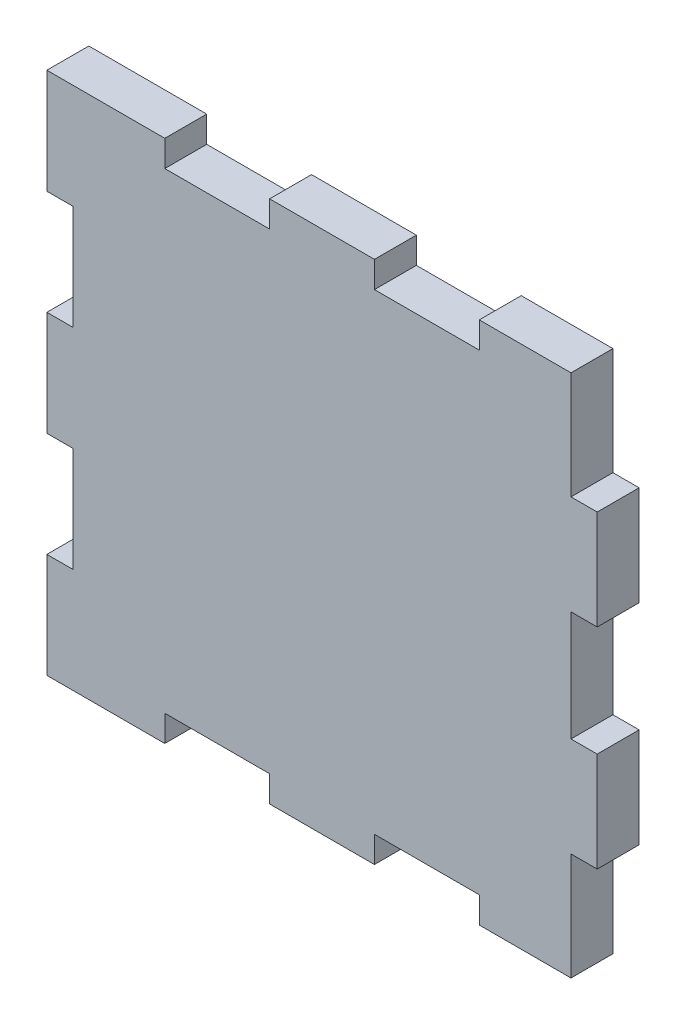
ISO-10303-21;
HEADER;
FILE_DESCRIPTION(('STEP AP214'),'2;1');
FILE_NAME('part.step','',(''),(''),'','','');
FILE_SCHEMA(('AUTOMOTIVE_DESIGN { 1 0 10303 214 1 1 1 1 }'));
ENDSEC;
DATA;
#1=APPLICATION_CONTEXT('core data for automotive mechanical design processes');
#2=APPLICATION_PROTOCOL_DEFINITION('international standard','automotive_design',2000,#1);
#3=PRODUCT_CONTEXT('',#1,'mechanical');
#4=PRODUCT('Part','Part','',(#3));
#5=PRODUCT_RELATED_PRODUCT_CATEGORY('part','',(#4));
#6=PRODUCT_DEFINITION_FORMATION('','',#4);
#7=PRODUCT_DEFINITION_CONTEXT('part definition',#1,'design');
#8=PRODUCT_DEFINITION('design','',#6,#7);
#9=PRODUCT_DEFINITION_SHAPE('','',#8);
#10=(LENGTH_UNIT() NAMED_UNIT(*) SI_UNIT(.MILLI.,.METRE.));
#11=(NAMED_UNIT(*) PLANE_ANGLE_UNIT() SI_UNIT($,.RADIAN.));
#12=(NAMED_UNIT(*) SI_UNIT($,.STERADIAN.) SOLID_ANGLE_UNIT());
#13=UNCERTAINTY_MEASURE_WITH_UNIT(LENGTH_MEASURE(1.E-05),#10,'distance_accuracy_value','');
#14=(GEOMETRIC_REPRESENTATION_CONTEXT(3) GLOBAL_UNCERTAINTY_ASSIGNED_CONTEXT((#13)) GLOBAL_UNIT_ASSIGNED_CONTEXT((#10,
#11,#12)) REPRESENTATION_CONTEXT('',''));
#15=CARTESIAN_POINT('',(0.,0.,0.));
#16=DIRECTION('',(0.,0.,1.));
#17=DIRECTION('',(1.,0.,0.));
#18=AXIS2_PLACEMENT_3D('',#15,#16,#17);
#19=CARTESIAN_POINT('',(66.145833333333,-85.5,0.));
#20=DIRECTION('',(0.,0.,1.));
#21=DIRECTION('',(1.,0.,0.));
#22=AXIS2_PLACEMENT_3D('',#19,#20,#21);
#23=PLANE('',#22);
#24=DIRECTION('',(1.,0.,0.));
#25=VECTOR('',#24,1.);
#26=CARTESIAN_POINT('',(60.4,-75.5,0.));
#27=LINE('',#26,#25);
#28=CARTESIAN_POINT('',(55.9,-75.5,0.));
#29=VERTEX_POINT('',#28);
#30=CARTESIAN_POINT('',(60.4,-75.5,0.));
#31=VERTEX_POINT('',#30);
#32=EDGE_CURVE('E428',#29,#31,#27,.T.);
#33=ORIENTED_EDGE('',*,*,#32,.T.);
#34=DIRECTION('',(0.,1.,0.));
#35=VECTOR('',#34,1.);
#36=CARTESIAN_POINT('',(60.4,-76.5,0.));
#37=LINE('',#36,#35);
#38=CARTESIAN_POINT('',(60.4,-76.5,0.));
#39=VERTEX_POINT('',#38);
#40=EDGE_CURVE('E423',#31,#39,#37,.F.);
#41=ORIENTED_EDGE('',*,*,#40,.T.);
#42=DIRECTION('',(1.,0.,0.));
#43=VECTOR('',#42,1.);
#44=CARTESIAN_POINT('',(64.4,-76.5,0.));
#45=LINE('',#44,#43);
#46=CARTESIAN_POINT('',(64.4,-76.5,0.));
#47=VERTEX_POINT('',#46);
#48=EDGE_CURVE('E418',#39,#47,#45,.T.);
#49=ORIENTED_EDGE('',*,*,#48,.T.);
#50=DIRECTION('',(0.,1.,0.));
#51=VECTOR('',#50,1.);
#52=CARTESIAN_POINT('',(64.4,-75.5,0.));
#53=LINE('',#52,#51);
#54=CARTESIAN_POINT('',(64.4,-75.5,0.));
#55=VERTEX_POINT('',#54);
#56=EDGE_CURVE('E413',#47,#55,#53,.T.);
#57=ORIENTED_EDGE('',*,*,#56,.T.);
#58=DIRECTION('',(1.,0.,0.));
#59=VECTOR('',#58,1.);
#60=CARTESIAN_POINT('',(68.4,-75.5,0.));
#61=LINE('',#60,#59);
#62=CARTESIAN_POINT('',(68.4,-75.5,0.));
#63=VERTEX_POINT('',#62);
#64=EDGE_CURVE('E408',#55,#63,#61,.T.);
#65=ORIENTED_EDGE('',*,*,#64,.T.);
#66=DIRECTION('',(0.,1.,0.));
#67=VECTOR('',#66,1.);
#68=CARTESIAN_POINT('',(68.4,-76.5,0.));
#69=LINE('',#68,#67);
#70=CARTESIAN_POINT('',(68.4,-76.5,0.));
#71=VERTEX_POINT('',#70);
#72=EDGE_CURVE('E403',#63,#71,#69,.F.);
#73=ORIENTED_EDGE('',*,*,#72,.T.);
#74=DIRECTION('',(1.,0.,0.));
#75=VECTOR('',#74,1.);
#76=CARTESIAN_POINT('',(72.4,-76.5,0.));
#77=LINE('',#76,#75);
#78=CARTESIAN_POINT('',(72.4,-76.5,0.));
#79=VERTEX_POINT('',#78);
#80=EDGE_CURVE('E398',#71,#79,#77,.T.);
#81=ORIENTED_EDGE('',*,*,#80,.T.);
#82=DIRECTION('',(0.,1.,0.));
#83=VECTOR('',#82,1.);
#84=CARTESIAN_POINT('',(72.4,-75.5,0.));
#85=LINE('',#84,#83);
#86=CARTESIAN_POINT('',(72.4,-75.5,0.));
#87=VERTEX_POINT('',#86);
#88=EDGE_CURVE('E393',#79,#87,#85,.T.);
#89=ORIENTED_EDGE('',*,*,#88,.T.);
#90=DIRECTION('',(1.,0.,0.));
#91=VECTOR('',#90,1.);
#92=CARTESIAN_POINT('',(75.9,-75.5,0.));
#93=LINE('',#92,#91);
#94=CARTESIAN_POINT('',(75.9,-75.5,0.));
#95=VERTEX_POINT('',#94);
#96=EDGE_CURVE('E388',#87,#95,#93,.T.);
#97=ORIENTED_EDGE('',*,*,#96,.T.);
#98=DIRECTION('',(0.,1.,0.));
#99=VECTOR('',#98,1.);
#100=CARTESIAN_POINT('',(75.9,-79.6,0.));
#101=LINE('',#100,#99);
#102=CARTESIAN_POINT('',(75.9,-79.6,0.));
#103=VERTEX_POINT('',#102);
#104=EDGE_CURVE('E383',#95,#103,#101,.F.);
#105=ORIENTED_EDGE('',*,*,#104,.T.);
#106=DIRECTION('',(1.,0.,0.));
#107=VECTOR('',#106,1.);
#108=CARTESIAN_POINT('',(76.9,-79.6,0.));
#109=LINE('',#108,#107);
#110=CARTESIAN_POINT('',(76.9,-79.6,0.));
#111=VERTEX_POINT('',#110);
#112=EDGE_CURVE('E378',#103,#111,#109,.T.);
#113=ORIENTED_EDGE('',*,*,#112,.T.);
#114=DIRECTION('',(0.,1.,0.));
#115=VECTOR('',#114,1.);
#116=CARTESIAN_POINT('',(76.9,-83.4,0.));
#117=LINE('',#116,#115);
#118=CARTESIAN_POINT('',(76.9,-83.4,0.));
#119=VERTEX_POINT('',#118);
#120=EDGE_CURVE('E373',#111,#119,#117,.F.);
#121=ORIENTED_EDGE('',*,*,#120,.T.);
#122=DIRECTION('',(1.,0.,0.));
#123=VECTOR('',#122,1.);
#124=CARTESIAN_POINT('',(75.9,-83.4,0.));
#125=LINE('',#124,#123);
#126=CARTESIAN_POINT('',(75.9,-83.4,0.));
#127=VERTEX_POINT('',#126);
#128=EDGE_CURVE('E368',#119,#127,#125,.F.);
#129=ORIENTED_EDGE('',*,*,#128,.T.);
#130=DIRECTION('',(0.,1.,0.));
#131=VECTOR('',#130,1.);
#132=CARTESIAN_POINT('',(75.9,-87.6,0.));
#133=LINE('',#132,#131);
#134=CARTESIAN_POINT('',(75.9,-87.6,0.));
#135=VERTEX_POINT('',#134);
#136=EDGE_CURVE('E363',#127,#135,#133,.F.);
#137=ORIENTED_EDGE('',*,*,#136,.T.);
#138=DIRECTION('',(1.,0.,0.));
#139=VECTOR('',#138,1.);
#140=CARTESIAN_POINT('',(76.9,-87.6,0.));
#141=LINE('',#140,#139);
#142=CARTESIAN_POINT('',(76.9,-87.6,0.));
#143=VERTEX_POINT('',#142);
#144=EDGE_CURVE('E358',#135,#143,#141,.T.);
#145=ORIENTED_EDGE('',*,*,#144,.T.);
#146=DIRECTION('',(0.,1.,0.));
#147=VECTOR('',#146,1.);
#148=CARTESIAN_POINT('',(76.9,-91.4,0.));
#149=LINE('',#148,#147);
#150=CARTESIAN_POINT('',(76.9,-91.4,0.));
#151=VERTEX_POINT('',#150);
#152=EDGE_CURVE('E353',#143,#151,#149,.F.);
#153=ORIENTED_EDGE('',*,*,#152,.T.);
#154=DIRECTION('',(1.,0.,0.));
#155=VECTOR('',#154,1.);
#156=CARTESIAN_POINT('',(75.9,-91.4,0.));
#157=LINE('',#156,#155);
#158=CARTESIAN_POINT('',(75.9,-91.4,0.));
#159=VERTEX_POINT('',#158);
#160=EDGE_CURVE('E348',#151,#159,#157,.F.);
#161=ORIENTED_EDGE('',*,*,#160,.T.);
#162=DIRECTION('',(0.,1.,0.));
#163=VECTOR('',#162,1.);
#164=CARTESIAN_POINT('',(75.9,-95.5,0.));
#165=LINE('',#164,#163);
#166=CARTESIAN_POINT('',(75.9,-95.5,0.));
#167=VERTEX_POINT('',#166);
#168=EDGE_CURVE('E343',#159,#167,#165,.F.);
#169=ORIENTED_EDGE('',*,*,#168,.T.);
#170=DIRECTION('',(1.,0.,0.));
#171=VECTOR('',#170,1.);
#172=CARTESIAN_POINT('',(72.4,-95.5,0.));
#173=LINE('',#172,#171);
#174=CARTESIAN_POINT('',(72.4,-95.5,0.));
#175=VERTEX_POINT('',#174);
#176=EDGE_CURVE('E338',#167,#175,#173,.F.);
#177=ORIENTED_EDGE('',*,*,#176,.T.);
#178=DIRECTION('',(0.,1.,0.));
#179=VECTOR('',#178,1.);
#180=CARTESIAN_POINT('',(72.4,-94.5,0.));
#181=LINE('',#180,#179);
#182=CARTESIAN_POINT('',(72.4,-94.5,0.));
#183=VERTEX_POINT('',#182);
#184=EDGE_CURVE('E333',#175,#183,#181,.T.);
#185=ORIENTED_EDGE('',*,*,#184,.T.);
#186=DIRECTION('',(1.,0.,0.));
#187=VECTOR('',#186,1.);
#188=CARTESIAN_POINT('',(68.4,-94.5,0.));
#189=LINE('',#188,#187);
#190=CARTESIAN_POINT('',(68.4,-94.5,0.));
#191=VERTEX_POINT('',#190);
#192=EDGE_CURVE('E328',#183,#191,#189,.F.);
#193=ORIENTED_EDGE('',*,*,#192,.T.);
#194=DIRECTION('',(0.,1.,0.));
#195=VECTOR('',#194,1.);
#196=CARTESIAN_POINT('',(68.4,-95.5,0.));
#197=LINE('',#196,#195);
#198=CARTESIAN_POINT('',(68.4,-95.5,0.));
#199=VERTEX_POINT('',#198);
#200=EDGE_CURVE('E323',#191,#199,#197,.F.);
#201=ORIENTED_EDGE('',*,*,#200,.T.);
#202=DIRECTION('',(1.,0.,0.));
#203=VECTOR('',#202,1.);
#204=CARTESIAN_POINT('',(64.4,-95.5,0.));
#205=LINE('',#204,#203);
#206=CARTESIAN_POINT('',(64.4,-95.5,0.));
#207=VERTEX_POINT('',#206);
#208=EDGE_CURVE('E318',#199,#207,#205,.F.);
#209=ORIENTED_EDGE('',*,*,#208,.T.);
#210=DIRECTION('',(0.,1.,0.));
#211=VECTOR('',#210,1.);
#212=CARTESIAN_POINT('',(64.4,-94.5,0.));
#213=LINE('',#212,#211);
#214=CARTESIAN_POINT('',(64.4,-94.5,0.));
#215=VERTEX_POINT('',#214);
#216=EDGE_CURVE('E313',#207,#215,#213,.T.);
#217=ORIENTED_EDGE('',*,*,#216,.T.);
#218=DIRECTION('',(1.,0.,0.));
#219=VECTOR('',#218,1.);
#220=CARTESIAN_POINT('',(60.4,-94.5,0.));
#221=LINE('',#220,#219);
#222=CARTESIAN_POINT('',(60.4,-94.5,0.));
#223=VERTEX_POINT('',#222);
#224=EDGE_CURVE('E308',#215,#223,#221,.F.);
#225=ORIENTED_EDGE('',*,*,#224,.T.);
#226=DIRECTION('',(0.,1.,0.));
#227=VECTOR('',#226,1.);
#228=CARTESIAN_POINT('',(60.4,-95.5,0.));
#229=LINE('',#228,#227);
#230=CARTESIAN_POINT('',(60.4,-95.5,0.));
#231=VERTEX_POINT('',#230);
#232=EDGE_CURVE('E303',#223,#231,#229,.F.);
#233=ORIENTED_EDGE('',*,*,#232,.T.);
#234=DIRECTION('',(1.,0.,0.));
#235=VECTOR('',#234,1.);
#236=CARTESIAN_POINT('',(55.9,-95.5,0.));
#237=LINE('',#236,#235);
#238=CARTESIAN_POINT('',(55.9,-95.5,0.));
#239=VERTEX_POINT('',#238);
#240=EDGE_CURVE('E298',#231,#239,#237,.F.);
#241=ORIENTED_EDGE('',*,*,#240,.T.);
#242=DIRECTION('',(0.,1.,0.));
#243=VECTOR('',#242,1.);
#244=CARTESIAN_POINT('',(55.9,-91.5,0.));
#245=LINE('',#244,#243);
#246=CARTESIAN_POINT('',(55.9,-91.5,0.));
#247=VERTEX_POINT('',#246);
#248=EDGE_CURVE('E293',#239,#247,#245,.T.);
#249=ORIENTED_EDGE('',*,*,#248,.T.);
#250=DIRECTION('',(1.,0.,0.));
#251=VECTOR('',#250,1.);
#252=CARTESIAN_POINT('',(56.9,-91.5,0.));
#253=LINE('',#252,#251);
#254=CARTESIAN_POINT('',(56.9,-91.5,0.));
#255=VERTEX_POINT('',#254);
#256=EDGE_CURVE('E288',#247,#255,#253,.T.);
#257=ORIENTED_EDGE('',*,*,#256,.T.);
#258=DIRECTION('',(0.,1.,0.));
#259=VECTOR('',#258,1.);
#260=CARTESIAN_POINT('',(56.9,-87.5,0.));
#261=LINE('',#260,#259);
#262=CARTESIAN_POINT('',(56.9,-87.5,0.));
#263=VERTEX_POINT('',#262);
#264=EDGE_CURVE('E283',#255,#263,#261,.T.);
#265=ORIENTED_EDGE('',*,*,#264,.T.);
#266=DIRECTION('',(1.,0.,0.));
#267=VECTOR('',#266,1.);
#268=CARTESIAN_POINT('',(55.9,-87.5,0.));
#269=LINE('',#268,#267);
#270=CARTESIAN_POINT('',(55.9,-87.5,0.));
#271=VERTEX_POINT('',#270);
#272=EDGE_CURVE('E278',#263,#271,#269,.F.);
#273=ORIENTED_EDGE('',*,*,#272,.T.);
#274=DIRECTION('',(0.,1.,0.));
#275=VECTOR('',#274,1.);
#276=CARTESIAN_POINT('',(55.9,-83.5,0.));
#277=LINE('',#276,#275);
#278=CARTESIAN_POINT('',(55.9,-83.5,0.));
#279=VERTEX_POINT('',#278);
#280=EDGE_CURVE('E274',#271,#279,#277,.T.);
#281=ORIENTED_EDGE('',*,*,#280,.T.);
#282=DIRECTION('',(1.,0.,0.));
#283=VECTOR('',#282,1.);
#284=CARTESIAN_POINT('',(56.9,-83.5,0.));
#285=LINE('',#284,#283);
#286=CARTESIAN_POINT('',(56.9,-83.5,0.));
#287=VERTEX_POINT('',#286);
#288=EDGE_CURVE('E261',#279,#287,#285,.T.);
#289=ORIENTED_EDGE('',*,*,#288,.T.);
#290=DIRECTION('',(0.,1.,0.));
#291=VECTOR('',#290,1.);
#292=CARTESIAN_POINT('',(56.9,-79.5,0.));
#293=LINE('',#292,#291);
#294=CARTESIAN_POINT('',(56.9,-79.5,0.));
#295=VERTEX_POINT('',#294);
#296=EDGE_CURVE('E246',#287,#295,#293,.T.);
#297=ORIENTED_EDGE('',*,*,#296,.T.);
#298=DIRECTION('',(1.,0.,0.));
#299=VECTOR('',#298,1.);
#300=CARTESIAN_POINT('',(55.9,-79.5,0.));
#301=LINE('',#300,#299);
#302=CARTESIAN_POINT('',(55.9,-79.5,0.));
#303=VERTEX_POINT('',#302);
#304=EDGE_CURVE('E19',#295,#303,#301,.F.);
#305=ORIENTED_EDGE('',*,*,#304,.T.);
#306=DIRECTION('',(0.,1.,0.));
#307=VECTOR('',#306,1.);
#308=CARTESIAN_POINT('',(55.9,-75.5,0.));
#309=LINE('',#308,#307);
#310=EDGE_CURVE('E432',#303,#29,#309,.T.);
#311=ORIENTED_EDGE('',*,*,#310,.T.);
#312=EDGE_LOOP('',(#33,#41,#49,#57,#65,#73,#81,#89,#97,#105,#113,#121,#129,#137,#145,#153,#161,
#169,#177,#185,#193,#201,#209,#217,#225,#233,#241,#249,#257,#265,#273,#281,#289,#297,#305,#311));
#313=FACE_BOUND('',#312,.T.);
#314=ADVANCED_FACE('F16',(#313),#23,.F.);
#315=CARTESIAN_POINT('',(55.9,-79.5,0.));
#316=DIRECTION('',(0.,1.,0.));
#317=DIRECTION('',(0.,0.,1.));
#318=AXIS2_PLACEMENT_3D('',#315,#316,#317);
#319=PLANE('',#318);
#320=DIRECTION('',(0.,0.,-1.));
#321=VECTOR('',#320,1.);
#322=CARTESIAN_POINT('',(56.9,-79.5,0.));
#323=LINE('',#322,#321);
#324=CARTESIAN_POINT('',(56.9,-79.5,1.6));
#325=VERTEX_POINT('',#324);
#326=EDGE_CURVE('E252',#295,#325,#323,.F.);
#327=ORIENTED_EDGE('',*,*,#326,.T.);
#328=DIRECTION('',(1.,0.,0.));
#329=VECTOR('',#328,1.);
#330=CARTESIAN_POINT('',(66.145833333333,-79.5,1.6));
#331=LINE('',#330,#329);
#332=CARTESIAN_POINT('',(55.9,-79.5,1.6));
#333=VERTEX_POINT('',#332);
#334=EDGE_CURVE('E434',#333,#325,#331,.T.);
#335=ORIENTED_EDGE('',*,*,#334,.F.);
#336=DIRECTION('',(0.,0.,-1.));
#337=VECTOR('',#336,1.);
#338=CARTESIAN_POINT('',(55.9,-79.5,0.));
#339=LINE('',#338,#337);
#340=EDGE_CURVE('E255',#333,#303,#339,.T.);
#341=ORIENTED_EDGE('',*,*,#340,.T.);
#342=ORIENTED_EDGE('',*,*,#304,.F.);
#343=EDGE_LOOP('',(#327,#335,#341,#342));
#344=FACE_BOUND('',#343,.T.);
#345=ADVANCED_FACE('F251',(#344),#319,.F.);
#346=CARTESIAN_POINT('',(56.9,-79.5,0.));
#347=DIRECTION('',(1.,0.,0.));
#348=DIRECTION('',(0.,0.,-1.));
#349=AXIS2_PLACEMENT_3D('',#346,#347,#348);
#350=PLANE('',#349);
#351=DIRECTION('',(0.,0.,-1.));
#352=VECTOR('',#351,1.);
#353=CARTESIAN_POINT('',(56.9,-83.5,0.));
#354=LINE('',#353,#352);
#355=CARTESIAN_POINT('',(56.9,-83.5,1.6));
#356=VERTEX_POINT('',#355);
#357=EDGE_CURVE('E263',#287,#356,#354,.F.);
#358=ORIENTED_EDGE('',*,*,#357,.T.);
#359=DIRECTION('',(0.,1.,0.));
#360=VECTOR('',#359,1.);
#361=CARTESIAN_POINT('',(56.9,-85.5,1.6));
#362=LINE('',#361,#360);
#363=EDGE_CURVE('E267',#325,#356,#362,.F.);
#364=ORIENTED_EDGE('',*,*,#363,.F.);
#365=ORIENTED_EDGE('',*,*,#326,.F.);
#366=ORIENTED_EDGE('',*,*,#296,.F.);
#367=EDGE_LOOP('',(#358,#364,#365,#366));
#368=FACE_BOUND('',#367,.T.);
#369=ADVANCED_FACE('F265',(#368),#350,.F.);
#370=CARTESIAN_POINT('',(56.9,-83.5,0.));
#371=DIRECTION('',(0.,-1.,0.));
#372=DIRECTION('',(0.,0.,-1.));
#373=AXIS2_PLACEMENT_3D('',#370,#371,#372);
#374=PLANE('',#373);
#375=DIRECTION('',(0.,0.,-1.));
#376=VECTOR('',#375,1.);
#377=CARTESIAN_POINT('',(55.9,-83.5,0.));
#378=LINE('',#377,#376);
#379=CARTESIAN_POINT('',(55.9,-83.5,1.6));
#380=VERTEX_POINT('',#379);
#381=EDGE_CURVE('E272',#279,#380,#378,.F.);
#382=ORIENTED_EDGE('',*,*,#381,.T.);
#383=DIRECTION('',(1.,0.,0.));
#384=VECTOR('',#383,1.);
#385=CARTESIAN_POINT('',(66.145833333333,-83.5,1.6));
#386=LINE('',#385,#384);
#387=EDGE_CURVE('E437',#356,#380,#386,.F.);
#388=ORIENTED_EDGE('',*,*,#387,.F.);
#389=ORIENTED_EDGE('',*,*,#357,.F.);
#390=ORIENTED_EDGE('',*,*,#288,.F.);
#391=EDGE_LOOP('',(#382,#388,#389,#390));
#392=FACE_BOUND('',#391,.T.);
#393=ADVANCED_FACE('F675',(#392),#374,.F.);
#394=CARTESIAN_POINT('',(55.9,-83.5,0.));
#395=DIRECTION('',(1.,0.,0.));
#396=DIRECTION('',(0.,0.,-1.));
#397=AXIS2_PLACEMENT_3D('',#394,#395,#396);
#398=PLANE('',#397);
#399=DIRECTION('',(0.,0.,1.));
#400=VECTOR('',#399,1.);
#401=CARTESIAN_POINT('',(55.9,-87.5,0.));
#402=LINE('',#401,#400);
#403=CARTESIAN_POINT('',(55.9,-87.5,1.6));
#404=VERTEX_POINT('',#403);
#405=EDGE_CURVE('E276',#271,#404,#402,.T.);
#406=ORIENTED_EDGE('',*,*,#405,.T.);
#407=DIRECTION('',(0.,1.,0.));
#408=VECTOR('',#407,1.);
#409=CARTESIAN_POINT('',(55.9,-85.5,1.6));
#410=LINE('',#409,#408);
#411=EDGE_CURVE('E440',#380,#404,#410,.F.);
#412=ORIENTED_EDGE('',*,*,#411,.F.);
#413=ORIENTED_EDGE('',*,*,#381,.F.);
#414=ORIENTED_EDGE('',*,*,#280,.F.);
#415=EDGE_LOOP('',(#406,#412,#413,#414));
#416=FACE_BOUND('',#415,.T.);
#417=ADVANCED_FACE('F671',(#416),#398,.F.);
#418=CARTESIAN_POINT('',(55.9,-87.5,0.));
#419=DIRECTION('',(0.,1.,0.));
#420=DIRECTION('',(0.,0.,1.));
#421=AXIS2_PLACEMENT_3D('',#418,#419,#420);
#422=PLANE('',#421);
#423=DIRECTION('',(0.,0.,-1.));
#424=VECTOR('',#423,1.);
#425=CARTESIAN_POINT('',(56.9,-87.5,0.));
#426=LINE('',#425,#424);
#427=CARTESIAN_POINT('',(56.9,-87.5,1.6));
#428=VERTEX_POINT('',#427);
#429=EDGE_CURVE('E281',#263,#428,#426,.F.);
#430=ORIENTED_EDGE('',*,*,#429,.T.);
#431=DIRECTION('',(1.,0.,0.));
#432=VECTOR('',#431,1.);
#433=CARTESIAN_POINT('',(66.145833333333,-87.5,1.6));
#434=LINE('',#433,#432);
#435=EDGE_CURVE('E443',#404,#428,#434,.T.);
#436=ORIENTED_EDGE('',*,*,#435,.F.);
#437=ORIENTED_EDGE('',*,*,#405,.F.);
#438=ORIENTED_EDGE('',*,*,#272,.F.);
#439=EDGE_LOOP('',(#430,#436,#437,#438));
#440=FACE_BOUND('',#439,.T.);
#441=ADVANCED_FACE('F667',(#440),#422,.F.);
#442=CARTESIAN_POINT('',(56.9,-87.5,0.));
#443=DIRECTION('',(1.,0.,0.));
#444=DIRECTION('',(0.,0.,-1.));
#445=AXIS2_PLACEMENT_3D('',#442,#443,#444);
#446=PLANE('',#445);
#447=DIRECTION('',(0.,0.,-1.));
#448=VECTOR('',#447,1.);
#449=CARTESIAN_POINT('',(56.9,-91.5,0.));
#450=LINE('',#449,#448);
#451=CARTESIAN_POINT('',(56.9,-91.5,1.6));
#452=VERTEX_POINT('',#451);
#453=EDGE_CURVE('E286',#255,#452,#450,.F.);
#454=ORIENTED_EDGE('',*,*,#453,.T.);
#455=DIRECTION('',(0.,1.,0.));
#456=VECTOR('',#455,1.);
#457=CARTESIAN_POINT('',(56.9,-85.5,1.6));
#458=LINE('',#457,#456);
#459=EDGE_CURVE('E446',#428,#452,#458,.F.);
#460=ORIENTED_EDGE('',*,*,#459,.F.);
#461=ORIENTED_EDGE('',*,*,#429,.F.);
#462=ORIENTED_EDGE('',*,*,#264,.F.);
#463=EDGE_LOOP('',(#454,#460,#461,#462));
#464=FACE_BOUND('',#463,.T.);
#465=ADVANCED_FACE('F663',(#464),#446,.F.);
#466=CARTESIAN_POINT('',(56.9,-91.5,0.));
#467=DIRECTION('',(0.,-1.,0.));
#468=DIRECTION('',(0.,0.,-1.));
#469=AXIS2_PLACEMENT_3D('',#466,#467,#468);
#470=PLANE('',#469);
#471=DIRECTION('',(0.,0.,-1.));
#472=VECTOR('',#471,1.);
#473=CARTESIAN_POINT('',(55.9,-91.5,0.));
#474=LINE('',#473,#472);
#475=CARTESIAN_POINT('',(55.9,-91.5,1.6));
#476=VERTEX_POINT('',#475);
#477=EDGE_CURVE('E291',#247,#476,#474,.F.);
#478=ORIENTED_EDGE('',*,*,#477,.T.);
#479=DIRECTION('',(1.,0.,0.));
#480=VECTOR('',#479,1.);
#481=CARTESIAN_POINT('',(66.145833333333,-91.5,1.6));
#482=LINE('',#481,#480);
#483=EDGE_CURVE('E449',#452,#476,#482,.F.);
#484=ORIENTED_EDGE('',*,*,#483,.F.);
#485=ORIENTED_EDGE('',*,*,#453,.F.);
#486=ORIENTED_EDGE('',*,*,#256,.F.);
#487=EDGE_LOOP('',(#478,#484,#485,#486));
#488=FACE_BOUND('',#487,.T.);
#489=ADVANCED_FACE('F659',(#488),#470,.F.);
#490=CARTESIAN_POINT('',(55.9,-91.5,0.));
#491=DIRECTION('',(1.,0.,0.));
#492=DIRECTION('',(0.,0.,-1.));
#493=AXIS2_PLACEMENT_3D('',#490,#491,#492);
#494=PLANE('',#493);
#495=DIRECTION('',(0.,0.,1.));
#496=VECTOR('',#495,1.);
#497=CARTESIAN_POINT('',(55.9,-95.5,0.));
#498=LINE('',#497,#496);
#499=CARTESIAN_POINT('',(55.9,-95.5,1.6));
#500=VERTEX_POINT('',#499);
#501=EDGE_CURVE('E296',#239,#500,#498,.T.);
#502=ORIENTED_EDGE('',*,*,#501,.T.);
#503=DIRECTION('',(0.,1.,0.));
#504=VECTOR('',#503,1.);
#505=CARTESIAN_POINT('',(55.9,-85.5,1.6));
#506=LINE('',#505,#504);
#507=EDGE_CURVE('E452',#476,#500,#506,.F.);
#508=ORIENTED_EDGE('',*,*,#507,.F.);
#509=ORIENTED_EDGE('',*,*,#477,.F.);
#510=ORIENTED_EDGE('',*,*,#248,.F.);
#511=EDGE_LOOP('',(#502,#508,#509,#510));
#512=FACE_BOUND('',#511,.T.);
#513=ADVANCED_FACE('F655',(#512),#494,.F.);
#514=CARTESIAN_POINT('',(55.9,-95.5,0.));
#515=DIRECTION('',(0.,1.,0.));
#516=DIRECTION('',(0.,0.,1.));
#517=AXIS2_PLACEMENT_3D('',#514,#515,#516);
#518=PLANE('',#517);
#519=DIRECTION('',(0.,0.,1.));
#520=VECTOR('',#519,1.);
#521=CARTESIAN_POINT('',(60.4,-95.5,0.));
#522=LINE('',#521,#520);
#523=CARTESIAN_POINT('',(60.4,-95.5,1.6));
#524=VERTEX_POINT('',#523);
#525=EDGE_CURVE('E301',#231,#524,#522,.T.);
#526=ORIENTED_EDGE('',*,*,#525,.T.);
#527=DIRECTION('',(1.,0.,0.));
#528=VECTOR('',#527,1.);
#529=CARTESIAN_POINT('',(66.145833333333,-95.5,1.6));
#530=LINE('',#529,#528);
#531=EDGE_CURVE('E455',#500,#524,#530,.T.);
#532=ORIENTED_EDGE('',*,*,#531,.F.);
#533=ORIENTED_EDGE('',*,*,#501,.F.);
#534=ORIENTED_EDGE('',*,*,#240,.F.);
#535=EDGE_LOOP('',(#526,#532,#533,#534));
#536=FACE_BOUND('',#535,.T.);
#537=ADVANCED_FACE('F651',(#536),#518,.F.);
#538=CARTESIAN_POINT('',(60.4,-95.5,0.));
#539=DIRECTION('',(-1.,0.,0.));
#540=DIRECTION('',(0.,0.,1.));
#541=AXIS2_PLACEMENT_3D('',#538,#539,#540);
#542=PLANE('',#541);
#543=DIRECTION('',(0.,0.,1.));
#544=VECTOR('',#543,1.);
#545=CARTESIAN_POINT('',(60.4,-94.5,0.));
#546=LINE('',#545,#544);
#547=CARTESIAN_POINT('',(60.4,-94.5,1.6));
#548=VERTEX_POINT('',#547);
#549=EDGE_CURVE('E306',#223,#548,#546,.T.);
#550=ORIENTED_EDGE('',*,*,#549,.T.);
#551=DIRECTION('',(0.,1.,0.));
#552=VECTOR('',#551,1.);
#553=CARTESIAN_POINT('',(60.4,-85.5,1.6));
#554=LINE('',#553,#552);
#555=EDGE_CURVE('E458',#524,#548,#554,.T.);
#556=ORIENTED_EDGE('',*,*,#555,.F.);
#557=ORIENTED_EDGE('',*,*,#525,.F.);
#558=ORIENTED_EDGE('',*,*,#232,.F.);
#559=EDGE_LOOP('',(#550,#556,#557,#558));
#560=FACE_BOUND('',#559,.T.);
#561=ADVANCED_FACE('F647',(#560),#542,.F.);
#562=CARTESIAN_POINT('',(60.4,-94.5,0.));
#563=DIRECTION('',(0.,1.,0.));
#564=DIRECTION('',(0.,0.,1.));
#565=AXIS2_PLACEMENT_3D('',#562,#563,#564);
#566=PLANE('',#565);
#567=DIRECTION('',(0.,0.,-1.));
#568=VECTOR('',#567,1.);
#569=CARTESIAN_POINT('',(64.4,-94.5,0.));
#570=LINE('',#569,#568);
#571=CARTESIAN_POINT('',(64.4,-94.5,1.6));
#572=VERTEX_POINT('',#571);
#573=EDGE_CURVE('E311',#215,#572,#570,.F.);
#574=ORIENTED_EDGE('',*,*,#573,.T.);
#575=DIRECTION('',(1.,0.,0.));
#576=VECTOR('',#575,1.);
#577=CARTESIAN_POINT('',(66.145833333333,-94.5,1.6));
#578=LINE('',#577,#576);
#579=EDGE_CURVE('E461',#548,#572,#578,.T.);
#580=ORIENTED_EDGE('',*,*,#579,.F.);
#581=ORIENTED_EDGE('',*,*,#549,.F.);
#582=ORIENTED_EDGE('',*,*,#224,.F.);
#583=EDGE_LOOP('',(#574,#580,#581,#582));
#584=FACE_BOUND('',#583,.T.);
#585=ADVANCED_FACE('F643',(#584),#566,.F.);
#586=CARTESIAN_POINT('',(64.4,-94.5,0.));
#587=DIRECTION('',(1.,0.,0.));
#588=DIRECTION('',(0.,0.,-1.));
#589=AXIS2_PLACEMENT_3D('',#586,#587,#588);
#590=PLANE('',#589);
#591=DIRECTION('',(0.,0.,1.));
#592=VECTOR('',#591,1.);
#593=CARTESIAN_POINT('',(64.4,-95.5,0.));
#594=LINE('',#593,#592);
#595=CARTESIAN_POINT('',(64.4,-95.5,1.6));
#596=VERTEX_POINT('',#595);
#597=EDGE_CURVE('E316',#207,#596,#594,.T.);
#598=ORIENTED_EDGE('',*,*,#597,.T.);
#599=DIRECTION('',(0.,1.,0.));
#600=VECTOR('',#599,1.);
#601=CARTESIAN_POINT('',(64.4,-85.5,1.6));
#602=LINE('',#601,#600);
#603=EDGE_CURVE('E464',#572,#596,#602,.F.);
#604=ORIENTED_EDGE('',*,*,#603,.F.);
#605=ORIENTED_EDGE('',*,*,#573,.F.);
#606=ORIENTED_EDGE('',*,*,#216,.F.);
#607=EDGE_LOOP('',(#598,#604,#605,#606));
#608=FACE_BOUND('',#607,.T.);
#609=ADVANCED_FACE('F639',(#608),#590,.F.);
#610=CARTESIAN_POINT('',(64.4,-95.5,0.));
#611=DIRECTION('',(0.,1.,0.));
#612=DIRECTION('',(0.,0.,1.));
#613=AXIS2_PLACEMENT_3D('',#610,#611,#612);
#614=PLANE('',#613);
#615=DIRECTION('',(0.,0.,1.));
#616=VECTOR('',#615,1.);
#617=CARTESIAN_POINT('',(68.4,-95.5,0.));
#618=LINE('',#617,#616);
#619=CARTESIAN_POINT('',(68.4,-95.5,1.6));
#620=VERTEX_POINT('',#619);
#621=EDGE_CURVE('E321',#199,#620,#618,.T.);
#622=ORIENTED_EDGE('',*,*,#621,.T.);
#623=DIRECTION('',(1.,0.,0.));
#624=VECTOR('',#623,1.);
#625=CARTESIAN_POINT('',(66.145833333333,-95.5,1.6));
#626=LINE('',#625,#624);
#627=EDGE_CURVE('E467',#596,#620,#626,.T.);
#628=ORIENTED_EDGE('',*,*,#627,.F.);
#629=ORIENTED_EDGE('',*,*,#597,.F.);
#630=ORIENTED_EDGE('',*,*,#208,.F.);
#631=EDGE_LOOP('',(#622,#628,#629,#630));
#632=FACE_BOUND('',#631,.T.);
#633=ADVANCED_FACE('F635',(#632),#614,.F.);
#634=CARTESIAN_POINT('',(68.4,-95.5,0.));
#635=DIRECTION('',(-1.,0.,0.));
#636=DIRECTION('',(0.,0.,1.));
#637=AXIS2_PLACEMENT_3D('',#634,#635,#636);
#638=PLANE('',#637);
#639=DIRECTION('',(0.,0.,1.));
#640=VECTOR('',#639,1.);
#641=CARTESIAN_POINT('',(68.4,-94.5,0.));
#642=LINE('',#641,#640);
#643=CARTESIAN_POINT('',(68.4,-94.5,1.6));
#644=VERTEX_POINT('',#643);
#645=EDGE_CURVE('E326',#191,#644,#642,.T.);
#646=ORIENTED_EDGE('',*,*,#645,.T.);
#647=DIRECTION('',(0.,1.,0.));
#648=VECTOR('',#647,1.);
#649=CARTESIAN_POINT('',(68.4,-85.5,1.6));
#650=LINE('',#649,#648);
#651=EDGE_CURVE('E470',#620,#644,#650,.T.);
#652=ORIENTED_EDGE('',*,*,#651,.F.);
#653=ORIENTED_EDGE('',*,*,#621,.F.);
#654=ORIENTED_EDGE('',*,*,#200,.F.);
#655=EDGE_LOOP('',(#646,#652,#653,#654));
#656=FACE_BOUND('',#655,.T.);
#657=ADVANCED_FACE('F631',(#656),#638,.F.);
#658=CARTESIAN_POINT('',(68.4,-94.5,0.));
#659=DIRECTION('',(0.,1.,0.));
#660=DIRECTION('',(0.,0.,1.));
#661=AXIS2_PLACEMENT_3D('',#658,#659,#660);
#662=PLANE('',#661);
#663=DIRECTION('',(0.,0.,-1.));
#664=VECTOR('',#663,1.);
#665=CARTESIAN_POINT('',(72.4,-94.5,0.));
#666=LINE('',#665,#664);
#667=CARTESIAN_POINT('',(72.4,-94.5,1.6));
#668=VERTEX_POINT('',#667);
#669=EDGE_CURVE('E331',#183,#668,#666,.F.);
#670=ORIENTED_EDGE('',*,*,#669,.T.);
#671=DIRECTION('',(1.,0.,0.));
#672=VECTOR('',#671,1.);
#673=CARTESIAN_POINT('',(66.145833333333,-94.5,1.6));
#674=LINE('',#673,#672);
#675=EDGE_CURVE('E473',#644,#668,#674,.T.);
#676=ORIENTED_EDGE('',*,*,#675,.F.);
#677=ORIENTED_EDGE('',*,*,#645,.F.);
#678=ORIENTED_EDGE('',*,*,#192,.F.);
#679=EDGE_LOOP('',(#670,#676,#677,#678));
#680=FACE_BOUND('',#679,.T.);
#681=ADVANCED_FACE('F627',(#680),#662,.F.);
#682=CARTESIAN_POINT('',(72.4,-94.5,0.));
#683=DIRECTION('',(1.,0.,0.));
#684=DIRECTION('',(0.,0.,-1.));
#685=AXIS2_PLACEMENT_3D('',#682,#683,#684);
#686=PLANE('',#685);
#687=DIRECTION('',(0.,0.,1.));
#688=VECTOR('',#687,1.);
#689=CARTESIAN_POINT('',(72.4,-95.5,0.));
#690=LINE('',#689,#688);
#691=CARTESIAN_POINT('',(72.4,-95.5,1.6));
#692=VERTEX_POINT('',#691);
#693=EDGE_CURVE('E336',#175,#692,#690,.T.);
#694=ORIENTED_EDGE('',*,*,#693,.T.);
#695=DIRECTION('',(0.,1.,0.));
#696=VECTOR('',#695,1.);
#697=CARTESIAN_POINT('',(72.4,-85.5,1.6));
#698=LINE('',#697,#696);
#699=EDGE_CURVE('E476',#668,#692,#698,.F.);
#700=ORIENTED_EDGE('',*,*,#699,.F.);
#701=ORIENTED_EDGE('',*,*,#669,.F.);
#702=ORIENTED_EDGE('',*,*,#184,.F.);
#703=EDGE_LOOP('',(#694,#700,#701,#702));
#704=FACE_BOUND('',#703,.T.);
#705=ADVANCED_FACE('F623',(#704),#686,.F.);
#706=CARTESIAN_POINT('',(72.4,-95.5,0.));
#707=DIRECTION('',(0.,1.,0.));
#708=DIRECTION('',(0.,0.,1.));
#709=AXIS2_PLACEMENT_3D('',#706,#707,#708);
#710=PLANE('',#709);
#711=DIRECTION('',(0.,0.,1.));
#712=VECTOR('',#711,1.);
#713=CARTESIAN_POINT('',(75.9,-95.5,0.));
#714=LINE('',#713,#712);
#715=CARTESIAN_POINT('',(75.9,-95.5,1.6));
#716=VERTEX_POINT('',#715);
#717=EDGE_CURVE('E341',#167,#716,#714,.T.);
#718=ORIENTED_EDGE('',*,*,#717,.T.);
#719=DIRECTION('',(1.,0.,0.));
#720=VECTOR('',#719,1.);
#721=CARTESIAN_POINT('',(66.145833333333,-95.5,1.6));
#722=LINE('',#721,#720);
#723=EDGE_CURVE('E479',#692,#716,#722,.T.);
#724=ORIENTED_EDGE('',*,*,#723,.F.);
#725=ORIENTED_EDGE('',*,*,#693,.F.);
#726=ORIENTED_EDGE('',*,*,#176,.F.);
#727=EDGE_LOOP('',(#718,#724,#725,#726));
#728=FACE_BOUND('',#727,.T.);
#729=ADVANCED_FACE('F619',(#728),#710,.F.);
#730=CARTESIAN_POINT('',(75.9,-95.5,0.));
#731=DIRECTION('',(-1.,0.,0.));
#732=DIRECTION('',(0.,0.,1.));
#733=AXIS2_PLACEMENT_3D('',#730,#731,#732);
#734=PLANE('',#733);
#735=DIRECTION('',(0.,0.,1.));
#736=VECTOR('',#735,1.);
#737=CARTESIAN_POINT('',(75.9,-91.4,0.));
#738=LINE('',#737,#736);
#739=CARTESIAN_POINT('',(75.9,-91.4,1.6));
#740=VERTEX_POINT('',#739);
#741=EDGE_CURVE('E346',#159,#740,#738,.T.);
#742=ORIENTED_EDGE('',*,*,#741,.T.);
#743=DIRECTION('',(0.,1.,0.));
#744=VECTOR('',#743,1.);
#745=CARTESIAN_POINT('',(75.9,-85.5,1.6));
#746=LINE('',#745,#744);
#747=EDGE_CURVE('E482',#716,#740,#746,.T.);
#748=ORIENTED_EDGE('',*,*,#747,.F.);
#749=ORIENTED_EDGE('',*,*,#717,.F.);
#750=ORIENTED_EDGE('',*,*,#168,.F.);
#751=EDGE_LOOP('',(#742,#748,#749,#750));
#752=FACE_BOUND('',#751,.T.);
#753=ADVANCED_FACE('F615',(#752),#734,.F.);
#754=CARTESIAN_POINT('',(75.9,-91.4,0.));
#755=DIRECTION('',(0.,1.,0.));
#756=DIRECTION('',(0.,0.,1.));
#757=AXIS2_PLACEMENT_3D('',#754,#755,#756);
#758=PLANE('',#757);
#759=DIRECTION('',(0.,0.,1.));
#760=VECTOR('',#759,1.);
#761=CARTESIAN_POINT('',(76.9,-91.4,0.));
#762=LINE('',#761,#760);
#763=CARTESIAN_POINT('',(76.9,-91.4,1.6));
#764=VERTEX_POINT('',#763);
#765=EDGE_CURVE('E351',#151,#764,#762,.T.);
#766=ORIENTED_EDGE('',*,*,#765,.T.);
#767=DIRECTION('',(1.,0.,0.));
#768=VECTOR('',#767,1.);
#769=CARTESIAN_POINT('',(66.145833333333,-91.4,1.6));
#770=LINE('',#769,#768);
#771=EDGE_CURVE('E485',#740,#764,#770,.T.);
#772=ORIENTED_EDGE('',*,*,#771,.F.);
#773=ORIENTED_EDGE('',*,*,#741,.F.);
#774=ORIENTED_EDGE('',*,*,#160,.F.);
#775=EDGE_LOOP('',(#766,#772,#773,#774));
#776=FACE_BOUND('',#775,.T.);
#777=ADVANCED_FACE('F611',(#776),#758,.F.);
#778=CARTESIAN_POINT('',(76.9,-91.4,0.));
#779=DIRECTION('',(-1.,0.,0.));
#780=DIRECTION('',(0.,0.,1.));
#781=AXIS2_PLACEMENT_3D('',#778,#779,#780);
#782=PLANE('',#781);
#783=DIRECTION('',(0.,0.,-1.));
#784=VECTOR('',#783,1.);
#785=CARTESIAN_POINT('',(76.9,-87.6,0.));
#786=LINE('',#785,#784);
#787=CARTESIAN_POINT('',(76.9,-87.6,1.6));
#788=VERTEX_POINT('',#787);
#789=EDGE_CURVE('E356',#143,#788,#786,.F.);
#790=ORIENTED_EDGE('',*,*,#789,.T.);
#791=DIRECTION('',(0.,1.,0.));
#792=VECTOR('',#791,1.);
#793=CARTESIAN_POINT('',(76.9,-85.5,1.6));
#794=LINE('',#793,#792);
#795=EDGE_CURVE('E488',#764,#788,#794,.T.);
#796=ORIENTED_EDGE('',*,*,#795,.F.);
#797=ORIENTED_EDGE('',*,*,#765,.F.);
#798=ORIENTED_EDGE('',*,*,#152,.F.);
#799=EDGE_LOOP('',(#790,#796,#797,#798));
#800=FACE_BOUND('',#799,.T.);
#801=ADVANCED_FACE('F607',(#800),#782,.F.);
#802=CARTESIAN_POINT('',(76.9,-87.6,0.));
#803=DIRECTION('',(0.,-1.,0.));
#804=DIRECTION('',(0.,0.,-1.));
#805=AXIS2_PLACEMENT_3D('',#802,#803,#804);
#806=PLANE('',#805);
#807=DIRECTION('',(0.,0.,1.));
#808=VECTOR('',#807,1.);
#809=CARTESIAN_POINT('',(75.9,-87.6,0.));
#810=LINE('',#809,#808);
#811=CARTESIAN_POINT('',(75.9,-87.6,1.6));
#812=VERTEX_POINT('',#811);
#813=EDGE_CURVE('E361',#135,#812,#810,.T.);
#814=ORIENTED_EDGE('',*,*,#813,.T.);
#815=DIRECTION('',(1.,0.,0.));
#816=VECTOR('',#815,1.);
#817=CARTESIAN_POINT('',(66.145833333333,-87.6,1.6));
#818=LINE('',#817,#816);
#819=EDGE_CURVE('E491',#788,#812,#818,.F.);
#820=ORIENTED_EDGE('',*,*,#819,.F.);
#821=ORIENTED_EDGE('',*,*,#789,.F.);
#822=ORIENTED_EDGE('',*,*,#144,.F.);
#823=EDGE_LOOP('',(#814,#820,#821,#822));
#824=FACE_BOUND('',#823,.T.);
#825=ADVANCED_FACE('F603',(#824),#806,.F.);
#826=CARTESIAN_POINT('',(75.9,-87.6,0.));
#827=DIRECTION('',(-1.,0.,0.));
#828=DIRECTION('',(0.,0.,1.));
#829=AXIS2_PLACEMENT_3D('',#826,#827,#828);
#830=PLANE('',#829);
#831=DIRECTION('',(0.,0.,1.));
#832=VECTOR('',#831,1.);
#833=CARTESIAN_POINT('',(75.9,-83.4,0.));
#834=LINE('',#833,#832);
#835=CARTESIAN_POINT('',(75.9,-83.4,1.6));
#836=VERTEX_POINT('',#835);
#837=EDGE_CURVE('E366',#127,#836,#834,.T.);
#838=ORIENTED_EDGE('',*,*,#837,.T.);
#839=DIRECTION('',(0.,1.,0.));
#840=VECTOR('',#839,1.);
#841=CARTESIAN_POINT('',(75.9,-85.5,1.6));
#842=LINE('',#841,#840);
#843=EDGE_CURVE('E494',#812,#836,#842,.T.);
#844=ORIENTED_EDGE('',*,*,#843,.F.);
#845=ORIENTED_EDGE('',*,*,#813,.F.);
#846=ORIENTED_EDGE('',*,*,#136,.F.);
#847=EDGE_LOOP('',(#838,#844,#845,#846));
#848=FACE_BOUND('',#847,.T.);
#849=ADVANCED_FACE('F599',(#848),#830,.F.);
#850=CARTESIAN_POINT('',(75.9,-83.4,0.));
#851=DIRECTION('',(0.,1.,0.));
#852=DIRECTION('',(0.,0.,1.));
#853=AXIS2_PLACEMENT_3D('',#850,#851,#852);
#854=PLANE('',#853);
#855=DIRECTION('',(0.,0.,1.));
#856=VECTOR('',#855,1.);
#857=CARTESIAN_POINT('',(76.9,-83.4,0.));
#858=LINE('',#857,#856);
#859=CARTESIAN_POINT('',(76.9,-83.4,1.6));
#860=VERTEX_POINT('',#859);
#861=EDGE_CURVE('E371',#119,#860,#858,.T.);
#862=ORIENTED_EDGE('',*,*,#861,.T.);
#863=DIRECTION('',(1.,0.,0.));
#864=VECTOR('',#863,1.);
#865=CARTESIAN_POINT('',(66.145833333333,-83.4,1.6));
#866=LINE('',#865,#864);
#867=EDGE_CURVE('E497',#836,#860,#866,.T.);
#868=ORIENTED_EDGE('',*,*,#867,.F.);
#869=ORIENTED_EDGE('',*,*,#837,.F.);
#870=ORIENTED_EDGE('',*,*,#128,.F.);
#871=EDGE_LOOP('',(#862,#868,#869,#870));
#872=FACE_BOUND('',#871,.T.);
#873=ADVANCED_FACE('F595',(#872),#854,.F.);
#874=CARTESIAN_POINT('',(76.9,-83.4,0.));
#875=DIRECTION('',(-1.,0.,0.));
#876=DIRECTION('',(0.,0.,1.));
#877=AXIS2_PLACEMENT_3D('',#874,#875,#876);
#878=PLANE('',#877);
#879=DIRECTION('',(0.,0.,-1.));
#880=VECTOR('',#879,1.);
#881=CARTESIAN_POINT('',(76.9,-79.6,0.));
#882=LINE('',#881,#880);
#883=CARTESIAN_POINT('',(76.9,-79.6,1.6));
#884=VERTEX_POINT('',#883);
#885=EDGE_CURVE('E376',#111,#884,#882,.F.);
#886=ORIENTED_EDGE('',*,*,#885,.T.);
#887=DIRECTION('',(0.,1.,0.));
#888=VECTOR('',#887,1.);
#889=CARTESIAN_POINT('',(76.9,-85.5,1.6));
#890=LINE('',#889,#888);
#891=EDGE_CURVE('E500',#860,#884,#890,.T.);
#892=ORIENTED_EDGE('',*,*,#891,.F.);
#893=ORIENTED_EDGE('',*,*,#861,.F.);
#894=ORIENTED_EDGE('',*,*,#120,.F.);
#895=EDGE_LOOP('',(#886,#892,#893,#894));
#896=FACE_BOUND('',#895,.T.);
#897=ADVANCED_FACE('F591',(#896),#878,.F.);
#898=CARTESIAN_POINT('',(76.9,-79.6,0.));
#899=DIRECTION('',(0.,-1.,0.));
#900=DIRECTION('',(0.,0.,-1.));
#901=AXIS2_PLACEMENT_3D('',#898,#899,#900);
#902=PLANE('',#901);
#903=DIRECTION('',(0.,0.,1.));
#904=VECTOR('',#903,1.);
#905=CARTESIAN_POINT('',(75.9,-79.6,0.));
#906=LINE('',#905,#904);
#907=CARTESIAN_POINT('',(75.9,-79.6,1.6));
#908=VERTEX_POINT('',#907);
#909=EDGE_CURVE('E381',#103,#908,#906,.T.);
#910=ORIENTED_EDGE('',*,*,#909,.T.);
#911=DIRECTION('',(1.,0.,0.));
#912=VECTOR('',#911,1.);
#913=CARTESIAN_POINT('',(66.145833333333,-79.6,1.6));
#914=LINE('',#913,#912);
#915=EDGE_CURVE('E503',#884,#908,#914,.F.);
#916=ORIENTED_EDGE('',*,*,#915,.F.);
#917=ORIENTED_EDGE('',*,*,#885,.F.);
#918=ORIENTED_EDGE('',*,*,#112,.F.);
#919=EDGE_LOOP('',(#910,#916,#917,#918));
#920=FACE_BOUND('',#919,.T.);
#921=ADVANCED_FACE('F587',(#920),#902,.F.);
#922=CARTESIAN_POINT('',(75.9,-79.6,0.));
#923=DIRECTION('',(-1.,0.,0.));
#924=DIRECTION('',(0.,0.,1.));
#925=AXIS2_PLACEMENT_3D('',#922,#923,#924);
#926=PLANE('',#925);
#927=DIRECTION('',(0.,0.,-1.));
#928=VECTOR('',#927,1.);
#929=CARTESIAN_POINT('',(75.9,-75.5,0.));
#930=LINE('',#929,#928);
#931=CARTESIAN_POINT('',(75.9,-75.5,1.6));
#932=VERTEX_POINT('',#931);
#933=EDGE_CURVE('E386',#95,#932,#930,.F.);
#934=ORIENTED_EDGE('',*,*,#933,.T.);
#935=DIRECTION('',(0.,1.,0.));
#936=VECTOR('',#935,1.);
#937=CARTESIAN_POINT('',(75.9,-85.5,1.6));
#938=LINE('',#937,#936);
#939=EDGE_CURVE('E506',#908,#932,#938,.T.);
#940=ORIENTED_EDGE('',*,*,#939,.F.);
#941=ORIENTED_EDGE('',*,*,#909,.F.);
#942=ORIENTED_EDGE('',*,*,#104,.F.);
#943=EDGE_LOOP('',(#934,#940,#941,#942));
#944=FACE_BOUND('',#943,.T.);
#945=ADVANCED_FACE('F583',(#944),#926,.F.);
#946=CARTESIAN_POINT('',(75.9,-75.5,0.));
#947=DIRECTION('',(0.,-1.,0.));
#948=DIRECTION('',(0.,0.,-1.));
#949=AXIS2_PLACEMENT_3D('',#946,#947,#948);
#950=PLANE('',#949);
#951=DIRECTION('',(0.,0.,-1.));
#952=VECTOR('',#951,1.);
#953=CARTESIAN_POINT('',(72.4,-75.5,0.));
#954=LINE('',#953,#952);
#955=CARTESIAN_POINT('',(72.4,-75.5,1.6));
#956=VERTEX_POINT('',#955);
#957=EDGE_CURVE('E391',#87,#956,#954,.F.);
#958=ORIENTED_EDGE('',*,*,#957,.T.);
#959=DIRECTION('',(1.,0.,0.));
#960=VECTOR('',#959,1.);
#961=CARTESIAN_POINT('',(66.145833333333,-75.5,1.6));
#962=LINE('',#961,#960);
#963=EDGE_CURVE('E509',#932,#956,#962,.F.);
#964=ORIENTED_EDGE('',*,*,#963,.F.);
#965=ORIENTED_EDGE('',*,*,#933,.F.);
#966=ORIENTED_EDGE('',*,*,#96,.F.);
#967=EDGE_LOOP('',(#958,#964,#965,#966));
#968=FACE_BOUND('',#967,.T.);
#969=ADVANCED_FACE('F579',(#968),#950,.F.);
#970=CARTESIAN_POINT('',(72.4,-75.5,0.));
#971=DIRECTION('',(1.,0.,0.));
#972=DIRECTION('',(0.,0.,-1.));
#973=AXIS2_PLACEMENT_3D('',#970,#971,#972);
#974=PLANE('',#973);
#975=DIRECTION('',(0.,0.,-1.));
#976=VECTOR('',#975,1.);
#977=CARTESIAN_POINT('',(72.4,-76.5,0.));
#978=LINE('',#977,#976);
#979=CARTESIAN_POINT('',(72.4,-76.5,1.6));
#980=VERTEX_POINT('',#979);
#981=EDGE_CURVE('E396',#79,#980,#978,.F.);
#982=ORIENTED_EDGE('',*,*,#981,.T.);
#983=DIRECTION('',(0.,1.,0.));
#984=VECTOR('',#983,1.);
#985=CARTESIAN_POINT('',(72.4,-85.5,1.6));
#986=LINE('',#985,#984);
#987=EDGE_CURVE('E512',#956,#980,#986,.F.);
#988=ORIENTED_EDGE('',*,*,#987,.F.);
#989=ORIENTED_EDGE('',*,*,#957,.F.);
#990=ORIENTED_EDGE('',*,*,#88,.F.);
#991=EDGE_LOOP('',(#982,#988,#989,#990));
#992=FACE_BOUND('',#991,.T.);
#993=ADVANCED_FACE('F575',(#992),#974,.F.);
#994=CARTESIAN_POINT('',(72.4,-76.5,0.));
#995=DIRECTION('',(0.,-1.,0.));
#996=DIRECTION('',(0.,0.,-1.));
#997=AXIS2_PLACEMENT_3D('',#994,#995,#996);
#998=PLANE('',#997);
#999=DIRECTION('',(0.,0.,1.));
#1000=VECTOR('',#999,1.);
#1001=CARTESIAN_POINT('',(68.4,-76.5,0.));
#1002=LINE('',#1001,#1000);
#1003=CARTESIAN_POINT('',(68.4,-76.5,1.6));
#1004=VERTEX_POINT('',#1003);
#1005=EDGE_CURVE('E401',#71,#1004,#1002,.T.);
#1006=ORIENTED_EDGE('',*,*,#1005,.T.);
#1007=DIRECTION('',(1.,0.,0.));
#1008=VECTOR('',#1007,1.);
#1009=CARTESIAN_POINT('',(66.145833333333,-76.5,1.6));
#1010=LINE('',#1009,#1008);
#1011=EDGE_CURVE('E515',#980,#1004,#1010,.F.);
#1012=ORIENTED_EDGE('',*,*,#1011,.F.);
#1013=ORIENTED_EDGE('',*,*,#981,.F.);
#1014=ORIENTED_EDGE('',*,*,#80,.F.);
#1015=EDGE_LOOP('',(#1006,#1012,#1013,#1014));
#1016=FACE_BOUND('',#1015,.T.);
#1017=ADVANCED_FACE('F571',(#1016),#998,.F.);
#1018=CARTESIAN_POINT('',(68.4,-76.5,0.));
#1019=DIRECTION('',(-1.,0.,0.));
#1020=DIRECTION('',(0.,0.,1.));
#1021=AXIS2_PLACEMENT_3D('',#1018,#1019,#1020);
#1022=PLANE('',#1021);
#1023=DIRECTION('',(0.,0.,-1.));
#1024=VECTOR('',#1023,1.);
#1025=CARTESIAN_POINT('',(68.4,-75.5,0.));
#1026=LINE('',#1025,#1024);
#1027=CARTESIAN_POINT('',(68.4,-75.5,1.6));
#1028=VERTEX_POINT('',#1027);
#1029=EDGE_CURVE('E406',#63,#1028,#1026,.F.);
#1030=ORIENTED_EDGE('',*,*,#1029,.T.);
#1031=DIRECTION('',(0.,1.,0.));
#1032=VECTOR('',#1031,1.);
#1033=CARTESIAN_POINT('',(68.4,-85.5,1.6));
#1034=LINE('',#1033,#1032);
#1035=EDGE_CURVE('E518',#1004,#1028,#1034,.T.);
#1036=ORIENTED_EDGE('',*,*,#1035,.F.);
#1037=ORIENTED_EDGE('',*,*,#1005,.F.);
#1038=ORIENTED_EDGE('',*,*,#72,.F.);
#1039=EDGE_LOOP('',(#1030,#1036,#1037,#1038));
#1040=FACE_BOUND('',#1039,.T.);
#1041=ADVANCED_FACE('F567',(#1040),#1022,.F.);
#1042=CARTESIAN_POINT('',(68.4,-75.5,0.));
#1043=DIRECTION('',(0.,-1.,0.));
#1044=DIRECTION('',(0.,0.,-1.));
#1045=AXIS2_PLACEMENT_3D('',#1042,#1043,#1044);
#1046=PLANE('',#1045);
#1047=DIRECTION('',(0.,0.,-1.));
#1048=VECTOR('',#1047,1.);
#1049=CARTESIAN_POINT('',(64.4,-75.5,0.));
#1050=LINE('',#1049,#1048);
#1051=CARTESIAN_POINT('',(64.4,-75.5,1.6));
#1052=VERTEX_POINT('',#1051);
#1053=EDGE_CURVE('E411',#55,#1052,#1050,.F.);
#1054=ORIENTED_EDGE('',*,*,#1053,.T.);
#1055=DIRECTION('',(1.,0.,0.));
#1056=VECTOR('',#1055,1.);
#1057=CARTESIAN_POINT('',(66.145833333333,-75.5,1.6));
#1058=LINE('',#1057,#1056);
#1059=EDGE_CURVE('E521',#1028,#1052,#1058,.F.);
#1060=ORIENTED_EDGE('',*,*,#1059,.F.);
#1061=ORIENTED_EDGE('',*,*,#1029,.F.);
#1062=ORIENTED_EDGE('',*,*,#64,.F.);
#1063=EDGE_LOOP('',(#1054,#1060,#1061,#1062));
#1064=FACE_BOUND('',#1063,.T.);
#1065=ADVANCED_FACE('F563',(#1064),#1046,.F.);
#1066=CARTESIAN_POINT('',(64.4,-75.5,0.));
#1067=DIRECTION('',(1.,0.,0.));
#1068=DIRECTION('',(0.,0.,-1.));
#1069=AXIS2_PLACEMENT_3D('',#1066,#1067,#1068);
#1070=PLANE('',#1069);
#1071=DIRECTION('',(0.,0.,-1.));
#1072=VECTOR('',#1071,1.);
#1073=CARTESIAN_POINT('',(64.4,-76.5,0.));
#1074=LINE('',#1073,#1072);
#1075=CARTESIAN_POINT('',(64.4,-76.5,1.6));
#1076=VERTEX_POINT('',#1075);
#1077=EDGE_CURVE('E416',#47,#1076,#1074,.F.);
#1078=ORIENTED_EDGE('',*,*,#1077,.T.);
#1079=DIRECTION('',(0.,1.,0.));
#1080=VECTOR('',#1079,1.);
#1081=CARTESIAN_POINT('',(64.4,-85.5,1.6));
#1082=LINE('',#1081,#1080);
#1083=EDGE_CURVE('E524',#1052,#1076,#1082,.F.);
#1084=ORIENTED_EDGE('',*,*,#1083,.F.);
#1085=ORIENTED_EDGE('',*,*,#1053,.F.);
#1086=ORIENTED_EDGE('',*,*,#56,.F.);
#1087=EDGE_LOOP('',(#1078,#1084,#1085,#1086));
#1088=FACE_BOUND('',#1087,.T.);
#1089=ADVANCED_FACE('F559',(#1088),#1070,.F.);
#1090=CARTESIAN_POINT('',(64.4,-76.5,0.));
#1091=DIRECTION('',(0.,-1.,0.));
#1092=DIRECTION('',(0.,0.,-1.));
#1093=AXIS2_PLACEMENT_3D('',#1090,#1091,#1092);
#1094=PLANE('',#1093);
#1095=DIRECTION('',(0.,0.,1.));
#1096=VECTOR('',#1095,1.);
#1097=CARTESIAN_POINT('',(60.4,-76.5,0.));
#1098=LINE('',#1097,#1096);
#1099=CARTESIAN_POINT('',(60.4,-76.5,1.6));
#1100=VERTEX_POINT('',#1099);
#1101=EDGE_CURVE('E421',#39,#1100,#1098,.T.);
#1102=ORIENTED_EDGE('',*,*,#1101,.T.);
#1103=DIRECTION('',(1.,0.,0.));
#1104=VECTOR('',#1103,1.);
#1105=CARTESIAN_POINT('',(66.145833333333,-76.5,1.6));
#1106=LINE('',#1105,#1104);
#1107=EDGE_CURVE('E527',#1076,#1100,#1106,.F.);
#1108=ORIENTED_EDGE('',*,*,#1107,.F.);
#1109=ORIENTED_EDGE('',*,*,#1077,.F.);
#1110=ORIENTED_EDGE('',*,*,#48,.F.);
#1111=EDGE_LOOP('',(#1102,#1108,#1109,#1110));
#1112=FACE_BOUND('',#1111,.T.);
#1113=ADVANCED_FACE('F556',(#1112),#1094,.F.);
#1114=CARTESIAN_POINT('',(60.4,-76.5,0.));
#1115=DIRECTION('',(-1.,0.,0.));
#1116=DIRECTION('',(0.,0.,1.));
#1117=AXIS2_PLACEMENT_3D('',#1114,#1115,#1116);
#1118=PLANE('',#1117);
#1119=DIRECTION('',(0.,0.,-1.));
#1120=VECTOR('',#1119,1.);
#1121=CARTESIAN_POINT('',(60.4,-75.5,0.));
#1122=LINE('',#1121,#1120);
#1123=CARTESIAN_POINT('',(60.4,-75.5,1.6));
#1124=VERTEX_POINT('',#1123);
#1125=EDGE_CURVE('E426',#31,#1124,#1122,.F.);
#1126=ORIENTED_EDGE('',*,*,#1125,.T.);
#1127=DIRECTION('',(0.,1.,0.));
#1128=VECTOR('',#1127,1.);
#1129=CARTESIAN_POINT('',(60.4,-85.5,1.6));
#1130=LINE('',#1129,#1128);
#1131=EDGE_CURVE('E530',#1100,#1124,#1130,.T.);
#1132=ORIENTED_EDGE('',*,*,#1131,.F.);
#1133=ORIENTED_EDGE('',*,*,#1101,.F.);
#1134=ORIENTED_EDGE('',*,*,#40,.F.);
#1135=EDGE_LOOP('',(#1126,#1132,#1133,#1134));
#1136=FACE_BOUND('',#1135,.T.);
#1137=ADVANCED_FACE('F540',(#1136),#1118,.F.);
#1138=CARTESIAN_POINT('',(60.4,-75.5,0.));
#1139=DIRECTION('',(0.,-1.,0.));
#1140=DIRECTION('',(0.,0.,-1.));
#1141=AXIS2_PLACEMENT_3D('',#1138,#1139,#1140);
#1142=PLANE('',#1141);
#1143=DIRECTION('',(0.,0.,-1.));
#1144=VECTOR('',#1143,1.);
#1145=CARTESIAN_POINT('',(55.9,-75.5,0.));
#1146=LINE('',#1145,#1144);
#1147=CARTESIAN_POINT('',(55.9,-75.5,1.6));
#1148=VERTEX_POINT('',#1147);
#1149=EDGE_CURVE('E34',#29,#1148,#1146,.F.);
#1150=ORIENTED_EDGE('',*,*,#1149,.T.);
#1151=DIRECTION('',(1.,0.,0.));
#1152=VECTOR('',#1151,1.);
#1153=CARTESIAN_POINT('',(66.145833333333,-75.5,1.6));
#1154=LINE('',#1153,#1152);
#1155=EDGE_CURVE('E25',#1124,#1148,#1154,.F.);
#1156=ORIENTED_EDGE('',*,*,#1155,.F.);
#1157=ORIENTED_EDGE('',*,*,#1125,.F.);
#1158=ORIENTED_EDGE('',*,*,#32,.F.);
#1159=EDGE_LOOP('',(#1150,#1156,#1157,#1158));
#1160=FACE_BOUND('',#1159,.T.);
#1161=ADVANCED_FACE('F538',(#1160),#1142,.F.);
#1162=CARTESIAN_POINT('',(55.9,-75.5,0.));
#1163=DIRECTION('',(1.,0.,0.));
#1164=DIRECTION('',(0.,0.,-1.));
#1165=AXIS2_PLACEMENT_3D('',#1162,#1163,#1164);
#1166=PLANE('',#1165);
#1167=ORIENTED_EDGE('',*,*,#340,.F.);
#1168=DIRECTION('',(0.,1.,0.));
#1169=VECTOR('',#1168,1.);
#1170=CARTESIAN_POINT('',(55.9,-85.5,1.6));
#1171=LINE('',#1170,#1169);
#1172=EDGE_CURVE('E10',#1148,#333,#1171,.F.);
#1173=ORIENTED_EDGE('',*,*,#1172,.F.);
#1174=ORIENTED_EDGE('',*,*,#1149,.F.);
#1175=ORIENTED_EDGE('',*,*,#310,.F.);
#1176=EDGE_LOOP('',(#1167,#1173,#1174,#1175));
#1177=FACE_BOUND('',#1176,.T.);
#1178=ADVANCED_FACE('F543',(#1177),#1166,.F.);
#1179=CARTESIAN_POINT('',(66.145833333333,-85.5,1.6));
#1180=DIRECTION('',(0.,0.,1.));
#1181=DIRECTION('',(1.,0.,0.));
#1182=AXIS2_PLACEMENT_3D('',#1179,#1180,#1181);
#1183=PLANE('',#1182);
#1184=ORIENTED_EDGE('',*,*,#1155,.T.);
#1185=ORIENTED_EDGE('',*,*,#1172,.T.);
#1186=ORIENTED_EDGE('',*,*,#334,.T.);
#1187=ORIENTED_EDGE('',*,*,#363,.T.);
#1188=ORIENTED_EDGE('',*,*,#387,.T.);
#1189=ORIENTED_EDGE('',*,*,#411,.T.);
#1190=ORIENTED_EDGE('',*,*,#435,.T.);
#1191=ORIENTED_EDGE('',*,*,#459,.T.);
#1192=ORIENTED_EDGE('',*,*,#483,.T.);
#1193=ORIENTED_EDGE('',*,*,#507,.T.);
#1194=ORIENTED_EDGE('',*,*,#531,.T.);
#1195=ORIENTED_EDGE('',*,*,#555,.T.);
#1196=ORIENTED_EDGE('',*,*,#579,.T.);
#1197=ORIENTED_EDGE('',*,*,#603,.T.);
#1198=ORIENTED_EDGE('',*,*,#627,.T.);
#1199=ORIENTED_EDGE('',*,*,#651,.T.);
#1200=ORIENTED_EDGE('',*,*,#675,.T.);
#1201=ORIENTED_EDGE('',*,*,#699,.T.);
#1202=ORIENTED_EDGE('',*,*,#723,.T.);
#1203=ORIENTED_EDGE('',*,*,#747,.T.);
#1204=ORIENTED_EDGE('',*,*,#771,.T.);
#1205=ORIENTED_EDGE('',*,*,#795,.T.);
#1206=ORIENTED_EDGE('',*,*,#819,.T.);
#1207=ORIENTED_EDGE('',*,*,#843,.T.);
#1208=ORIENTED_EDGE('',*,*,#867,.T.);
#1209=ORIENTED_EDGE('',*,*,#891,.T.);
#1210=ORIENTED_EDGE('',*,*,#915,.T.);
#1211=ORIENTED_EDGE('',*,*,#939,.T.);
#1212=ORIENTED_EDGE('',*,*,#963,.T.);
#1213=ORIENTED_EDGE('',*,*,#987,.T.);
#1214=ORIENTED_EDGE('',*,*,#1011,.T.);
#1215=ORIENTED_EDGE('',*,*,#1035,.T.);
#1216=ORIENTED_EDGE('',*,*,#1059,.T.);
#1217=ORIENTED_EDGE('',*,*,#1083,.T.);
#1218=ORIENTED_EDGE('',*,*,#1107,.T.);
#1219=ORIENTED_EDGE('',*,*,#1131,.T.);
#1220=EDGE_LOOP('',(#1184,#1185,#1186,#1187,#1188,#1189,#1190,#1191,#1192,#1193,#1194,#1195,
#1196,#1197,#1198,#1199,#1200,#1201,#1202,#1203,#1204,#1205,#1206,#1207,#1208,#1209,#1210,#1211,
#1212,#1213,#1214,#1215,#1216,#1217,#1218,#1219));
#1221=FACE_BOUND('',#1220,.T.);
#1222=ADVANCED_FACE('F535',(#1221),#1183,.T.);
#1223=CLOSED_SHELL('',(#314,#345,#369,#393,#417,#441,#465,#489,#513,#537,#561,#585,#609,#633,
#657,#681,#705,#729,#753,#777,#801,#825,#849,#873,#897,#921,#945,#969,#993,#1017,#1041,#1065,
#1089,#1113,#1137,#1161,#1178,#1222));
#1224=MANIFOLD_SOLID_BREP('B1',#1223);
#1225=ADVANCED_BREP_SHAPE_REPRESENTATION('',(#18,#1224),#14);
#1226=SHAPE_DEFINITION_REPRESENTATION(#9,#1225);
ENDSEC;
END-ISO-10303-21;
